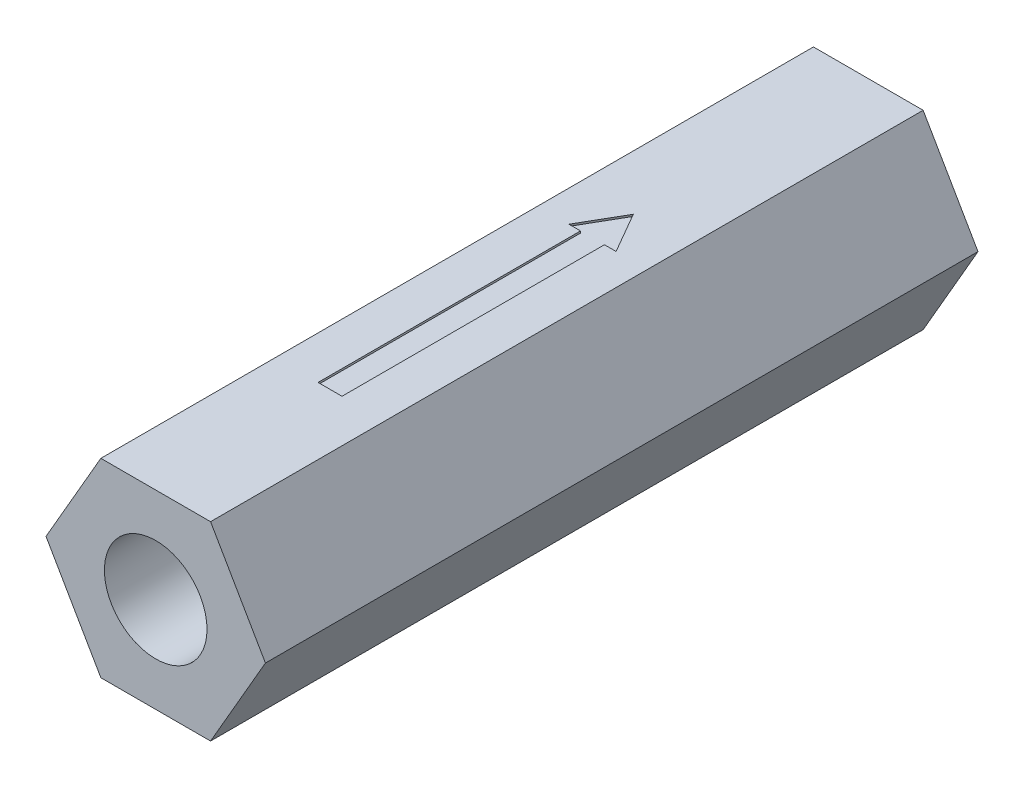
ISO-10303-21;
HEADER;
FILE_DESCRIPTION(('STEP AP214'),'2;1');
FILE_NAME('part.step','',(''),(''),'','','');
FILE_SCHEMA(('AUTOMOTIVE_DESIGN { 1 0 10303 214 1 1 1 1 }'));
ENDSEC;
DATA;
#1=APPLICATION_CONTEXT('core data for automotive mechanical design processes');
#2=APPLICATION_PROTOCOL_DEFINITION('international standard','automotive_design',2000,#1);
#3=PRODUCT_CONTEXT('',#1,'mechanical');
#4=PRODUCT('Part','Part','',(#3));
#5=PRODUCT_RELATED_PRODUCT_CATEGORY('part','',(#4));
#6=PRODUCT_DEFINITION_FORMATION('','',#4);
#7=PRODUCT_DEFINITION_CONTEXT('part definition',#1,'design');
#8=PRODUCT_DEFINITION('design','',#6,#7);
#9=PRODUCT_DEFINITION_SHAPE('','',#8);
#10=(LENGTH_UNIT() NAMED_UNIT(*) SI_UNIT(.MILLI.,.METRE.));
#11=(NAMED_UNIT(*) PLANE_ANGLE_UNIT() SI_UNIT($,.RADIAN.));
#12=(NAMED_UNIT(*) SI_UNIT($,.STERADIAN.) SOLID_ANGLE_UNIT());
#13=UNCERTAINTY_MEASURE_WITH_UNIT(LENGTH_MEASURE(1.E-05),#10,'distance_accuracy_value','');
#14=(GEOMETRIC_REPRESENTATION_CONTEXT(3) GLOBAL_UNCERTAINTY_ASSIGNED_CONTEXT((#13)) GLOBAL_UNIT_ASSIGNED_CONTEXT((#10,
#11,#12)) REPRESENTATION_CONTEXT('',''));
#15=CARTESIAN_POINT('',(0.,0.,0.));
#16=DIRECTION('',(0.,0.,1.));
#17=DIRECTION('',(1.,0.,0.));
#18=AXIS2_PLACEMENT_3D('',#15,#16,#17);
#19=CARTESIAN_POINT('',(7.3323484187084,-12.6999999999999,95.25));
#20=DIRECTION('',(-0.866025403784441,0.499999999999995,0.));
#21=DIRECTION('',(-0.499999999999995,-0.866025403784442,0.));
#22=AXIS2_PLACEMENT_3D('',#19,#20,#21);
#23=PLANE('',#22);
#24=DIRECTION('',(0.499999999999995,0.866025403784442,0.));
#25=VECTOR('',#24,1.);
#26=CARTESIAN_POINT('',(7.3323484187084,-12.6999999999999,0.));
#27=LINE('',#26,#25);
#28=CARTESIAN_POINT('',(7.3323484187084,-12.6999999999999,0.));
#29=VERTEX_POINT('',#28);
#30=CARTESIAN_POINT('',(14.6646968374165,0.,0.));
#31=VERTEX_POINT('',#30);
#32=EDGE_CURVE('E136',#29,#31,#27,.T.);
#33=ORIENTED_EDGE('',*,*,#32,.T.);
#34=DIRECTION('',(0.,0.,-1.));
#35=VECTOR('',#34,1.);
#36=CARTESIAN_POINT('',(14.6646968374165,0.,95.25));
#37=LINE('',#36,#35);
#38=CARTESIAN_POINT('',(14.6646968374165,0.,95.25));
#39=VERTEX_POINT('',#38);
#40=EDGE_CURVE('E11',#39,#31,#37,.T.);
#41=ORIENTED_EDGE('',*,*,#40,.F.);
#42=DIRECTION('',(0.499999999999995,0.866025403784442,0.));
#43=VECTOR('',#42,1.);
#44=CARTESIAN_POINT('',(7.3323484187084,-12.6999999999999,95.25));
#45=LINE('',#44,#43);
#46=CARTESIAN_POINT('',(7.3323484187084,-12.6999999999999,95.25));
#47=VERTEX_POINT('',#46);
#48=EDGE_CURVE('E148',#47,#39,#45,.T.);
#49=ORIENTED_EDGE('',*,*,#48,.F.);
#50=DIRECTION('',(0.,0.,-1.));
#51=VECTOR('',#50,1.);
#52=CARTESIAN_POINT('',(7.3323484187084,-12.6999999999999,95.25));
#53=LINE('',#52,#51);
#54=EDGE_CURVE('E132',#47,#29,#53,.T.);
#55=ORIENTED_EDGE('',*,*,#54,.T.);
#56=EDGE_LOOP('',(#33,#41,#49,#55));
#57=FACE_BOUND('',#56,.T.);
#58=ADVANCED_FACE('F40',(#57),#23,.F.);
#59=CARTESIAN_POINT('',(14.6646968374165,0.,95.25));
#60=DIRECTION('',(-0.866025403784438,-0.500000000000001,0.));
#61=DIRECTION('',(0.500000000000001,-0.866025403784438,0.));
#62=AXIS2_PLACEMENT_3D('',#59,#60,#61);
#63=PLANE('',#62);
#64=DIRECTION('',(-0.500000000000001,0.866025403784438,0.));
#65=VECTOR('',#64,1.);
#66=CARTESIAN_POINT('',(14.6646968374165,0.,0.));
#67=LINE('',#66,#65);
#68=CARTESIAN_POINT('',(7.33234841870822,12.7,0.));
#69=VERTEX_POINT('',#68);
#70=EDGE_CURVE('E139',#31,#69,#67,.T.);
#71=ORIENTED_EDGE('',*,*,#70,.T.);
#72=DIRECTION('',(0.,0.,-1.));
#73=VECTOR('',#72,1.);
#74=CARTESIAN_POINT('',(7.33234841870822,12.7,95.25));
#75=LINE('',#74,#73);
#76=CARTESIAN_POINT('',(7.33234841870822,12.7,95.25));
#77=VERTEX_POINT('',#76);
#78=EDGE_CURVE('E47',#77,#69,#75,.T.);
#79=ORIENTED_EDGE('',*,*,#78,.F.);
#80=DIRECTION('',(-0.500000000000001,0.866025403784438,0.));
#81=VECTOR('',#80,1.);
#82=CARTESIAN_POINT('',(14.6646968374165,0.,95.25));
#83=LINE('',#82,#81);
#84=EDGE_CURVE('E98',#39,#77,#83,.T.);
#85=ORIENTED_EDGE('',*,*,#84,.F.);
#86=ORIENTED_EDGE('',*,*,#40,.T.);
#87=EDGE_LOOP('',(#71,#79,#85,#86));
#88=FACE_BOUND('',#87,.T.);
#89=ADVANCED_FACE('F300',(#88),#63,.F.);
#90=CARTESIAN_POINT('',(7.33234841870822,12.7,95.25));
#91=DIRECTION('',(0.,-1.,0.));
#92=DIRECTION('',(1.,0.,0.));
#93=AXIS2_PLACEMENT_3D('',#90,#91,#92);
#94=PLANE('',#93);
#95=DIRECTION('',(0.,0.,1.));
#96=VECTOR('',#95,1.);
#97=CARTESIAN_POINT('',(-1.60045154196813,12.7,71.9490671710865));
#98=LINE('',#97,#96);
#99=CARTESIAN_POINT('',(-1.60045154196813,12.7,36.8665670362898));
#100=VERTEX_POINT('',#99);
#101=CARTESIAN_POINT('',(-1.60045154196813,12.7,71.9490671710865));
#102=VERTEX_POINT('',#101);
#103=EDGE_CURVE('E212',#100,#102,#98,.T.);
#104=ORIENTED_EDGE('',*,*,#103,.F.);
#105=DIRECTION('',(1.,0.,0.));
#106=VECTOR('',#105,1.);
#107=CARTESIAN_POINT('',(-3.153270171135,12.7,36.8665670362898));
#108=LINE('',#107,#106);
#109=CARTESIAN_POINT('',(-3.153270171135,12.7,36.8665670362898));
#110=VERTEX_POINT('',#109);
#111=EDGE_CURVE('E54',#110,#100,#108,.T.);
#112=ORIENTED_EDGE('',*,*,#111,.F.);
#113=DIRECTION('',(-0.499999999999998,0.,0.86602540378444));
#114=VECTOR('',#113,1.);
#115=CARTESIAN_POINT('',(0.,12.7,31.4049428898926));
#116=LINE('',#115,#114);
#117=CARTESIAN_POINT('',(0.,12.7,31.4049428898926));
#118=VERTEX_POINT('',#117);
#119=EDGE_CURVE('E196',#118,#110,#116,.T.);
#120=ORIENTED_EDGE('',*,*,#119,.F.);
#121=DIRECTION('',(-0.500000000000004,0.,-0.866025403784436));
#122=VECTOR('',#121,1.);
#123=CARTESIAN_POINT('',(3.15327017113494,12.7,36.8665670362897));
#124=LINE('',#123,#122);
#125=CARTESIAN_POINT('',(3.15327017113494,12.7,36.8665670362897));
#126=VERTEX_POINT('',#125);
#127=EDGE_CURVE('E200',#126,#118,#124,.T.);
#128=ORIENTED_EDGE('',*,*,#127,.F.);
#129=DIRECTION('',(1.,0.,0.));
#130=VECTOR('',#129,1.);
#131=CARTESIAN_POINT('',(1.60045154196804,12.7,36.8665670362897));
#132=LINE('',#131,#130);
#133=CARTESIAN_POINT('',(1.60045154196804,12.7,36.8665670362897));
#134=VERTEX_POINT('',#133);
#135=EDGE_CURVE('E203',#134,#126,#132,.T.);
#136=ORIENTED_EDGE('',*,*,#135,.F.);
#137=DIRECTION('',(0.,0.,-1.));
#138=VECTOR('',#137,1.);
#139=CARTESIAN_POINT('',(1.60045154196804,12.7,71.9490671710865));
#140=LINE('',#139,#138);
#141=CARTESIAN_POINT('',(1.60045154196804,12.7,71.9490671710865));
#142=VERTEX_POINT('',#141);
#143=EDGE_CURVE('E206',#142,#134,#140,.T.);
#144=ORIENTED_EDGE('',*,*,#143,.F.);
#145=DIRECTION('',(1.,0.,0.));
#146=VECTOR('',#145,1.);
#147=CARTESIAN_POINT('',(-1.60045154196813,12.7,71.9490671710865));
#148=LINE('',#147,#146);
#149=EDGE_CURVE('E209',#102,#142,#148,.T.);
#150=ORIENTED_EDGE('',*,*,#149,.F.);
#151=EDGE_LOOP('',(#104,#112,#120,#128,#136,#144,#150));
#152=FACE_BOUND('',#151,.T.);
#153=DIRECTION('',(-1.,0.,0.));
#154=VECTOR('',#153,1.);
#155=CARTESIAN_POINT('',(7.33234841870822,12.7,0.));
#156=LINE('',#155,#154);
#157=CARTESIAN_POINT('',(-7.33234841870831,12.7,0.));
#158=VERTEX_POINT('',#157);
#159=EDGE_CURVE('E142',#69,#158,#156,.T.);
#160=ORIENTED_EDGE('',*,*,#159,.T.);
#161=DIRECTION('',(0.,0.,-1.));
#162=VECTOR('',#161,1.);
#163=CARTESIAN_POINT('',(-7.33234841870831,12.7,95.25));
#164=LINE('',#163,#162);
#165=CARTESIAN_POINT('',(-7.33234841870831,12.7,95.25));
#166=VERTEX_POINT('',#165);
#167=EDGE_CURVE('E127',#166,#158,#164,.T.);
#168=ORIENTED_EDGE('',*,*,#167,.F.);
#169=DIRECTION('',(-1.,0.,0.));
#170=VECTOR('',#169,1.);
#171=CARTESIAN_POINT('',(7.33234841870822,12.7,95.25));
#172=LINE('',#171,#170);
#173=EDGE_CURVE('E115',#77,#166,#172,.T.);
#174=ORIENTED_EDGE('',*,*,#173,.F.);
#175=ORIENTED_EDGE('',*,*,#78,.T.);
#176=EDGE_LOOP('',(#160,#168,#174,#175));
#177=FACE_BOUND('',#176,.T.);
#178=ADVANCED_FACE('F154',(#152,#177),#94,.F.);
#179=CARTESIAN_POINT('',(-7.33234841870831,12.7,95.25));
#180=DIRECTION('',(0.866025403784441,-0.499999999999995,0.));
#181=DIRECTION('',(0.499999999999995,0.866025403784441,0.));
#182=AXIS2_PLACEMENT_3D('',#179,#180,#181);
#183=PLANE('',#182);
#184=DIRECTION('',(-0.499999999999995,-0.866025403784441,0.));
#185=VECTOR('',#184,1.);
#186=CARTESIAN_POINT('',(-7.33234841870831,12.7,0.));
#187=LINE('',#186,#185);
#188=CARTESIAN_POINT('',(-14.6646968374165,-1.02403030695263E-13,0.));
#189=VERTEX_POINT('',#188);
#190=EDGE_CURVE('E124',#158,#189,#187,.T.);
#191=ORIENTED_EDGE('',*,*,#190,.T.);
#192=DIRECTION('',(0.,0.,-1.));
#193=VECTOR('',#192,1.);
#194=CARTESIAN_POINT('',(-14.6646968374165,-1.02403030695263E-13,95.25));
#195=LINE('',#194,#193);
#196=CARTESIAN_POINT('',(-14.6646968374165,-1.02403030695263E-13,95.25));
#197=VERTEX_POINT('',#196);
#198=EDGE_CURVE('E121',#197,#189,#195,.T.);
#199=ORIENTED_EDGE('',*,*,#198,.F.);
#200=DIRECTION('',(-0.499999999999995,-0.866025403784441,0.));
#201=VECTOR('',#200,1.);
#202=CARTESIAN_POINT('',(-7.33234841870831,12.7,95.25));
#203=LINE('',#202,#201);
#204=EDGE_CURVE('E108',#166,#197,#203,.T.);
#205=ORIENTED_EDGE('',*,*,#204,.F.);
#206=ORIENTED_EDGE('',*,*,#167,.T.);
#207=EDGE_LOOP('',(#191,#199,#205,#206));
#208=FACE_BOUND('',#207,.T.);
#209=ADVANCED_FACE('F122',(#208),#183,.F.);
#210=CARTESIAN_POINT('',(-14.6646968374165,-1.02403030695263E-13,95.25));
#211=DIRECTION('',(0.866025403784434,0.500000000000007,0.));
#212=DIRECTION('',(-0.500000000000007,0.866025403784435,0.));
#213=AXIS2_PLACEMENT_3D('',#210,#211,#212);
#214=PLANE('',#213);
#215=DIRECTION('',(0.500000000000007,-0.866025403784435,0.));
#216=VECTOR('',#215,1.);
#217=CARTESIAN_POINT('',(-14.6646968374165,-1.02403030695263E-13,0.));
#218=LINE('',#217,#216);
#219=CARTESIAN_POINT('',(-7.33234841870814,-12.7000000000001,0.));
#220=VERTEX_POINT('',#219);
#221=EDGE_CURVE('E145',#189,#220,#218,.T.);
#222=ORIENTED_EDGE('',*,*,#221,.T.);
#223=DIRECTION('',(0.,0.,-1.));
#224=VECTOR('',#223,1.);
#225=CARTESIAN_POINT('',(-7.33234841870814,-12.7000000000001,95.25));
#226=LINE('',#225,#224);
#227=CARTESIAN_POINT('',(-7.33234841870814,-12.7000000000001,95.25));
#228=VERTEX_POINT('',#227);
#229=EDGE_CURVE('E128',#228,#220,#226,.T.);
#230=ORIENTED_EDGE('',*,*,#229,.F.);
#231=DIRECTION('',(0.500000000000007,-0.866025403784435,0.));
#232=VECTOR('',#231,1.);
#233=CARTESIAN_POINT('',(-14.6646968374165,-1.02403030695263E-13,95.25));
#234=LINE('',#233,#232);
#235=EDGE_CURVE('E112',#197,#228,#234,.T.);
#236=ORIENTED_EDGE('',*,*,#235,.F.);
#237=ORIENTED_EDGE('',*,*,#198,.T.);
#238=EDGE_LOOP('',(#222,#230,#236,#237));
#239=FACE_BOUND('',#238,.T.);
#240=ADVANCED_FACE('F130',(#239),#214,.F.);
#241=CARTESIAN_POINT('',(-7.33234841870814,-12.7000000000001,95.25));
#242=DIRECTION('',(0.,1.,0.));
#243=DIRECTION('',(-1.,0.,0.));
#244=AXIS2_PLACEMENT_3D('',#241,#242,#243);
#245=PLANE('',#244);
#246=DIRECTION('',(1.,0.,0.));
#247=VECTOR('',#246,1.);
#248=CARTESIAN_POINT('',(-7.33234841870814,-12.7000000000001,0.));
#249=LINE('',#248,#247);
#250=EDGE_CURVE('E90',#220,#29,#249,.T.);
#251=ORIENTED_EDGE('',*,*,#250,.T.);
#252=ORIENTED_EDGE('',*,*,#54,.F.);
#253=DIRECTION('',(1.,0.,0.));
#254=VECTOR('',#253,1.);
#255=CARTESIAN_POINT('',(-7.33234841870814,-12.7000000000001,95.25));
#256=LINE('',#255,#254);
#257=EDGE_CURVE('E63',#228,#47,#256,.T.);
#258=ORIENTED_EDGE('',*,*,#257,.F.);
#259=ORIENTED_EDGE('',*,*,#229,.T.);
#260=EDGE_LOOP('',(#251,#252,#258,#259));
#261=FACE_BOUND('',#260,.T.);
#262=ADVANCED_FACE('F158',(#261),#245,.F.);
#263=CARTESIAN_POINT('',(0.,0.,95.25));
#264=DIRECTION('',(0.,0.,1.));
#265=DIRECTION('',(1.,0.,0.));
#266=AXIS2_PLACEMENT_3D('',#263,#264,#265);
#267=PLANE('',#266);
#268=CARTESIAN_POINT('',(0.,0.,95.25));
#269=DIRECTION('',(0.,0.,1.));
#270=DIRECTION('',(1.,0.,0.));
#271=AXIS2_PLACEMENT_3D('',#268,#269,#270);
#272=CIRCLE('',#271,6.858);
#273=CARTESIAN_POINT('',(6.858,0.,95.25));
#274=VERTEX_POINT('',#273);
#275=EDGE_CURVE('E165',#274,#274,#272,.T.);
#276=ORIENTED_EDGE('',*,*,#275,.F.);
#277=EDGE_LOOP('',(#276));
#278=FACE_BOUND('',#277,.T.);
#279=ORIENTED_EDGE('',*,*,#48,.T.);
#280=ORIENTED_EDGE('',*,*,#84,.T.);
#281=ORIENTED_EDGE('',*,*,#173,.T.);
#282=ORIENTED_EDGE('',*,*,#204,.T.);
#283=ORIENTED_EDGE('',*,*,#235,.T.);
#284=ORIENTED_EDGE('',*,*,#257,.T.);
#285=EDGE_LOOP('',(#279,#280,#281,#282,#283,#284));
#286=FACE_BOUND('',#285,.T.);
#287=ADVANCED_FACE('F110',(#278,#286),#267,.T.);
#288=CARTESIAN_POINT('',(0.,0.,0.));
#289=DIRECTION('',(0.,0.,1.));
#290=DIRECTION('',(1.,0.,0.));
#291=AXIS2_PLACEMENT_3D('',#288,#289,#290);
#292=PLANE('',#291);
#293=CARTESIAN_POINT('',(0.,0.,0.));
#294=DIRECTION('',(0.,0.,-1.));
#295=DIRECTION('',(-1.,0.,0.));
#296=AXIS2_PLACEMENT_3D('',#293,#294,#295);
#297=CIRCLE('',#296,6.858);
#298=CARTESIAN_POINT('',(-6.858,0.,0.));
#299=VERTEX_POINT('',#298);
#300=EDGE_CURVE('E171',#299,#299,#297,.T.);
#301=ORIENTED_EDGE('',*,*,#300,.F.);
#302=EDGE_LOOP('',(#301));
#303=FACE_BOUND('',#302,.T.);
#304=ORIENTED_EDGE('',*,*,#32,.F.);
#305=ORIENTED_EDGE('',*,*,#250,.F.);
#306=ORIENTED_EDGE('',*,*,#221,.F.);
#307=ORIENTED_EDGE('',*,*,#190,.F.);
#308=ORIENTED_EDGE('',*,*,#159,.F.);
#309=ORIENTED_EDGE('',*,*,#70,.F.);
#310=EDGE_LOOP('',(#304,#305,#306,#307,#308,#309));
#311=FACE_BOUND('',#310,.T.);
#312=ADVANCED_FACE('F157',(#303,#311),#292,.F.);
#313=CARTESIAN_POINT('',(0.,0.,78.105));
#314=DIRECTION('',(0.,0.,1.));
#315=DIRECTION('',(1.,0.,0.));
#316=AXIS2_PLACEMENT_3D('',#313,#314,#315);
#317=CYLINDRICAL_SURFACE('',#316,6.858);
#318=CARTESIAN_POINT('',(0.,0.,78.105));
#319=DIRECTION('',(0.,0.,1.));
#320=DIRECTION('',(1.,0.,0.));
#321=AXIS2_PLACEMENT_3D('',#318,#319,#320);
#322=CIRCLE('',#321,6.858);
#323=CARTESIAN_POINT('',(6.858,0.,78.105));
#324=VERTEX_POINT('',#323);
#325=EDGE_CURVE('E140',#324,#324,#322,.T.);
#326=ORIENTED_EDGE('',*,*,#325,.F.);
#327=EDGE_LOOP('',(#326));
#328=FACE_BOUND('',#327,.T.);
#329=ORIENTED_EDGE('',*,*,#275,.T.);
#330=EDGE_LOOP('',(#329));
#331=FACE_BOUND('',#330,.T.);
#332=ADVANCED_FACE('F317',(#328,#331),#317,.F.);
#333=CARTESIAN_POINT('',(0.,0.,78.105));
#334=DIRECTION('',(0.,0.,1.));
#335=DIRECTION('',(1.,0.,0.));
#336=AXIS2_PLACEMENT_3D('',#333,#334,#335);
#337=PLANE('',#336);
#338=ORIENTED_EDGE('',*,*,#325,.T.);
#339=EDGE_LOOP('',(#338));
#340=FACE_BOUND('',#339,.T.);
#341=ADVANCED_FACE('F324',(#340),#337,.T.);
#342=CARTESIAN_POINT('',(0.,0.,17.145));
#343=DIRECTION('',(0.,0.,-1.));
#344=DIRECTION('',(-1.,0.,0.));
#345=AXIS2_PLACEMENT_3D('',#342,#343,#344);
#346=CYLINDRICAL_SURFACE('',#345,6.858);
#347=CARTESIAN_POINT('',(0.,0.,17.145));
#348=DIRECTION('',(0.,0.,-1.));
#349=DIRECTION('',(-1.,0.,0.));
#350=AXIS2_PLACEMENT_3D('',#347,#348,#349);
#351=CIRCLE('',#350,6.858);
#352=CARTESIAN_POINT('',(-6.858,0.,17.145));
#353=VERTEX_POINT('',#352);
#354=EDGE_CURVE('E168',#353,#353,#351,.T.);
#355=ORIENTED_EDGE('',*,*,#354,.F.);
#356=EDGE_LOOP('',(#355));
#357=FACE_BOUND('',#356,.T.);
#358=ORIENTED_EDGE('',*,*,#300,.T.);
#359=EDGE_LOOP('',(#358));
#360=FACE_BOUND('',#359,.T.);
#361=ADVANCED_FACE('F328',(#357,#360),#346,.F.);
#362=CARTESIAN_POINT('',(0.,0.,17.145));
#363=DIRECTION('',(0.,0.,-1.));
#364=DIRECTION('',(-1.,0.,0.));
#365=AXIS2_PLACEMENT_3D('',#362,#363,#364);
#366=PLANE('',#365);
#367=ORIENTED_EDGE('',*,*,#354,.T.);
#368=EDGE_LOOP('',(#367));
#369=FACE_BOUND('',#368,.T.);
#370=ADVANCED_FACE('F332',(#369),#366,.T.);
#371=CARTESIAN_POINT('',(-3.153270171135,12.446,36.8665670362898));
#372=DIRECTION('',(0.,0.,1.));
#373=DIRECTION('',(1.,0.,0.));
#374=AXIS2_PLACEMENT_3D('',#371,#372,#373);
#375=PLANE('',#374);
#376=ORIENTED_EDGE('',*,*,#111,.T.);
#377=DIRECTION('',(0.,1.,0.));
#378=VECTOR('',#377,1.);
#379=CARTESIAN_POINT('',(-1.60045154196813,12.446,36.8665670362898));
#380=LINE('',#379,#378);
#381=CARTESIAN_POINT('',(-1.60045154196813,12.446,36.8665670362898));
#382=VERTEX_POINT('',#381);
#383=EDGE_CURVE('E177',#382,#100,#380,.T.);
#384=ORIENTED_EDGE('',*,*,#383,.F.);
#385=DIRECTION('',(1.,0.,0.));
#386=VECTOR('',#385,1.);
#387=CARTESIAN_POINT('',(-3.153270171135,12.446,36.8665670362898));
#388=LINE('',#387,#386);
#389=CARTESIAN_POINT('',(-3.153270171135,12.446,36.8665670362898));
#390=VERTEX_POINT('',#389);
#391=EDGE_CURVE('E199',#390,#382,#388,.T.);
#392=ORIENTED_EDGE('',*,*,#391,.F.);
#393=DIRECTION('',(0.,1.,0.));
#394=VECTOR('',#393,1.);
#395=CARTESIAN_POINT('',(-3.153270171135,12.446,36.8665670362898));
#396=LINE('',#395,#394);
#397=EDGE_CURVE('E174',#390,#110,#396,.T.);
#398=ORIENTED_EDGE('',*,*,#397,.T.);
#399=EDGE_LOOP('',(#376,#384,#392,#398));
#400=FACE_BOUND('',#399,.T.);
#401=ADVANCED_FACE('F243',(#400),#375,.F.);
#402=CARTESIAN_POINT('',(0.,12.446,31.4049428898926));
#403=DIRECTION('',(-0.86602540378444,0.,-0.499999999999998));
#404=DIRECTION('',(-0.499999999999998,0.,0.86602540378444));
#405=AXIS2_PLACEMENT_3D('',#402,#403,#404);
#406=PLANE('',#405);
#407=ORIENTED_EDGE('',*,*,#119,.T.);
#408=ORIENTED_EDGE('',*,*,#397,.F.);
#409=DIRECTION('',(-0.499999999999998,0.,0.86602540378444));
#410=VECTOR('',#409,1.);
#411=CARTESIAN_POINT('',(0.,12.446,31.4049428898926));
#412=LINE('',#411,#410);
#413=CARTESIAN_POINT('',(0.,12.446,31.4049428898926));
#414=VERTEX_POINT('',#413);
#415=EDGE_CURVE('E180',#414,#390,#412,.T.);
#416=ORIENTED_EDGE('',*,*,#415,.F.);
#417=DIRECTION('',(0.,1.,0.));
#418=VECTOR('',#417,1.);
#419=CARTESIAN_POINT('',(0.,12.446,31.4049428898926));
#420=LINE('',#419,#418);
#421=EDGE_CURVE('E192',#414,#118,#420,.T.);
#422=ORIENTED_EDGE('',*,*,#421,.T.);
#423=EDGE_LOOP('',(#407,#408,#416,#422));
#424=FACE_BOUND('',#423,.T.);
#425=ADVANCED_FACE('F261',(#424),#406,.F.);
#426=CARTESIAN_POINT('',(3.15327017113494,12.446,36.8665670362897));
#427=DIRECTION('',(0.866025403784436,0.,-0.500000000000004));
#428=DIRECTION('',(-0.500000000000004,0.,-0.866025403784436));
#429=AXIS2_PLACEMENT_3D('',#426,#427,#428);
#430=PLANE('',#429);
#431=ORIENTED_EDGE('',*,*,#127,.T.);
#432=ORIENTED_EDGE('',*,*,#421,.F.);
#433=DIRECTION('',(-0.500000000000004,0.,-0.866025403784436));
#434=VECTOR('',#433,1.);
#435=CARTESIAN_POINT('',(3.15327017113494,12.446,36.8665670362897));
#436=LINE('',#435,#434);
#437=CARTESIAN_POINT('',(3.15327017113494,12.446,36.8665670362897));
#438=VERTEX_POINT('',#437);
#439=EDGE_CURVE('E218',#438,#414,#436,.T.);
#440=ORIENTED_EDGE('',*,*,#439,.F.);
#441=DIRECTION('',(0.,1.,0.));
#442=VECTOR('',#441,1.);
#443=CARTESIAN_POINT('',(3.15327017113494,12.446,36.8665670362897));
#444=LINE('',#443,#442);
#445=EDGE_CURVE('E189',#438,#126,#444,.T.);
#446=ORIENTED_EDGE('',*,*,#445,.T.);
#447=EDGE_LOOP('',(#431,#432,#440,#446));
#448=FACE_BOUND('',#447,.T.);
#449=ADVANCED_FACE('F266',(#448),#430,.F.);
#450=CARTESIAN_POINT('',(1.60045154196804,12.446,36.8665670362897));
#451=DIRECTION('',(0.,0.,1.));
#452=DIRECTION('',(1.,0.,0.));
#453=AXIS2_PLACEMENT_3D('',#450,#451,#452);
#454=PLANE('',#453);
#455=ORIENTED_EDGE('',*,*,#135,.T.);
#456=ORIENTED_EDGE('',*,*,#445,.F.);
#457=DIRECTION('',(1.,0.,0.));
#458=VECTOR('',#457,1.);
#459=CARTESIAN_POINT('',(1.60045154196804,12.446,36.8665670362897));
#460=LINE('',#459,#458);
#461=CARTESIAN_POINT('',(1.60045154196804,12.446,36.8665670362897));
#462=VERTEX_POINT('',#461);
#463=EDGE_CURVE('E221',#462,#438,#460,.T.);
#464=ORIENTED_EDGE('',*,*,#463,.F.);
#465=DIRECTION('',(0.,1.,0.));
#466=VECTOR('',#465,1.);
#467=CARTESIAN_POINT('',(1.60045154196804,12.446,36.8665670362897));
#468=LINE('',#467,#466);
#469=EDGE_CURVE('E186',#462,#134,#468,.T.);
#470=ORIENTED_EDGE('',*,*,#469,.T.);
#471=EDGE_LOOP('',(#455,#456,#464,#470));
#472=FACE_BOUND('',#471,.T.);
#473=ADVANCED_FACE('F288',(#472),#454,.F.);
#474=CARTESIAN_POINT('',(1.60045154196804,12.446,71.9490671710865));
#475=DIRECTION('',(1.,0.,0.));
#476=DIRECTION('',(0.,1.,0.));
#477=AXIS2_PLACEMENT_3D('',#474,#475,#476);
#478=PLANE('',#477);
#479=ORIENTED_EDGE('',*,*,#143,.T.);
#480=ORIENTED_EDGE('',*,*,#469,.F.);
#481=DIRECTION('',(0.,0.,-1.));
#482=VECTOR('',#481,1.);
#483=CARTESIAN_POINT('',(1.60045154196804,12.446,71.9490671710865));
#484=LINE('',#483,#482);
#485=CARTESIAN_POINT('',(1.60045154196804,12.446,71.9490671710865));
#486=VERTEX_POINT('',#485);
#487=EDGE_CURVE('E224',#486,#462,#484,.T.);
#488=ORIENTED_EDGE('',*,*,#487,.F.);
#489=DIRECTION('',(0.,1.,0.));
#490=VECTOR('',#489,1.);
#491=CARTESIAN_POINT('',(1.60045154196804,12.446,71.9490671710865));
#492=LINE('',#491,#490);
#493=EDGE_CURVE('E183',#486,#142,#492,.T.);
#494=ORIENTED_EDGE('',*,*,#493,.T.);
#495=EDGE_LOOP('',(#479,#480,#488,#494));
#496=FACE_BOUND('',#495,.T.);
#497=ADVANCED_FACE('F290',(#496),#478,.F.);
#498=CARTESIAN_POINT('',(-1.60045154196813,12.446,71.9490671710865));
#499=DIRECTION('',(0.,0.,1.));
#500=DIRECTION('',(1.,0.,0.));
#501=AXIS2_PLACEMENT_3D('',#498,#499,#500);
#502=PLANE('',#501);
#503=ORIENTED_EDGE('',*,*,#149,.T.);
#504=ORIENTED_EDGE('',*,*,#493,.F.);
#505=DIRECTION('',(1.,0.,0.));
#506=VECTOR('',#505,1.);
#507=CARTESIAN_POINT('',(-1.60045154196813,12.446,71.9490671710865));
#508=LINE('',#507,#506);
#509=CARTESIAN_POINT('',(-1.60045154196813,12.446,71.9490671710865));
#510=VERTEX_POINT('',#509);
#511=EDGE_CURVE('E227',#510,#486,#508,.T.);
#512=ORIENTED_EDGE('',*,*,#511,.F.);
#513=DIRECTION('',(0.,1.,0.));
#514=VECTOR('',#513,1.);
#515=CARTESIAN_POINT('',(-1.60045154196813,12.446,71.9490671710865));
#516=LINE('',#515,#514);
#517=EDGE_CURVE('E179',#510,#102,#516,.T.);
#518=ORIENTED_EDGE('',*,*,#517,.T.);
#519=EDGE_LOOP('',(#503,#504,#512,#518));
#520=FACE_BOUND('',#519,.T.);
#521=ADVANCED_FACE('F280',(#520),#502,.F.);
#522=CARTESIAN_POINT('',(-1.60045154196813,12.446,71.9490671710865));
#523=DIRECTION('',(-1.,0.,0.));
#524=DIRECTION('',(0.,-1.,0.));
#525=AXIS2_PLACEMENT_3D('',#522,#523,#524);
#526=PLANE('',#525);
#527=ORIENTED_EDGE('',*,*,#103,.T.);
#528=ORIENTED_EDGE('',*,*,#517,.F.);
#529=DIRECTION('',(0.,0.,1.));
#530=VECTOR('',#529,1.);
#531=CARTESIAN_POINT('',(-1.60045154196813,12.446,42.1963292255612));
#532=LINE('',#531,#530);
#533=EDGE_CURVE('E230',#382,#510,#532,.T.);
#534=ORIENTED_EDGE('',*,*,#533,.F.);
#535=ORIENTED_EDGE('',*,*,#383,.T.);
#536=EDGE_LOOP('',(#527,#528,#534,#535));
#537=FACE_BOUND('',#536,.T.);
#538=ADVANCED_FACE('F274',(#537),#526,.F.);
#539=CARTESIAN_POINT('',(0.,12.446,0.));
#540=DIRECTION('',(0.,1.,0.));
#541=DIRECTION('',(-1.,0.,0.));
#542=AXIS2_PLACEMENT_3D('',#539,#540,#541);
#543=PLANE('',#542);
#544=ORIENTED_EDGE('',*,*,#391,.T.);
#545=ORIENTED_EDGE('',*,*,#533,.T.);
#546=ORIENTED_EDGE('',*,*,#511,.T.);
#547=ORIENTED_EDGE('',*,*,#487,.T.);
#548=ORIENTED_EDGE('',*,*,#463,.T.);
#549=ORIENTED_EDGE('',*,*,#439,.T.);
#550=ORIENTED_EDGE('',*,*,#415,.T.);
#551=EDGE_LOOP('',(#544,#545,#546,#547,#548,#549,#550));
#552=FACE_BOUND('',#551,.T.);
#553=ADVANCED_FACE('F237',(#552),#543,.T.);
#554=CLOSED_SHELL('',(#58,#89,#178,#209,#240,#262,#287,#312,#332,#341,#361,#370,#401,#425,#449,
#473,#497,#521,#538,#553));
#555=MANIFOLD_SOLID_BREP('B2',#554);
#556=ADVANCED_BREP_SHAPE_REPRESENTATION('',(#18,#555),#14);
#557=SHAPE_DEFINITION_REPRESENTATION(#9,#556);
ENDSEC;
END-ISO-10303-21;
